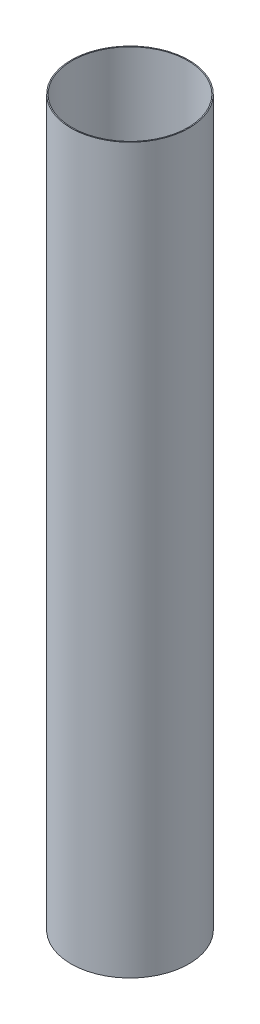
ISO-10303-21;
HEADER;
FILE_DESCRIPTION(('STEP AP214'),'2;1');
FILE_NAME('part.step','',(''),(''),'','','');
FILE_SCHEMA(('AUTOMOTIVE_DESIGN { 1 0 10303 214 1 1 1 1 }'));
ENDSEC;
DATA;
#1=APPLICATION_CONTEXT('core data for automotive mechanical design processes');
#2=APPLICATION_PROTOCOL_DEFINITION('international standard','automotive_design',2000,#1);
#3=PRODUCT_CONTEXT('',#1,'mechanical');
#4=PRODUCT('Part','Part','',(#3));
#5=PRODUCT_RELATED_PRODUCT_CATEGORY('part','',(#4));
#6=PRODUCT_DEFINITION_FORMATION('','',#4);
#7=PRODUCT_DEFINITION_CONTEXT('part definition',#1,'design');
#8=PRODUCT_DEFINITION('design','',#6,#7);
#9=PRODUCT_DEFINITION_SHAPE('','',#8);
#10=(LENGTH_UNIT() NAMED_UNIT(*) SI_UNIT(.MILLI.,.METRE.));
#11=(NAMED_UNIT(*) PLANE_ANGLE_UNIT() SI_UNIT($,.RADIAN.));
#12=(NAMED_UNIT(*) SI_UNIT($,.STERADIAN.) SOLID_ANGLE_UNIT());
#13=UNCERTAINTY_MEASURE_WITH_UNIT(LENGTH_MEASURE(1.E-05),#10,'distance_accuracy_value','');
#14=(GEOMETRIC_REPRESENTATION_CONTEXT(3) GLOBAL_UNCERTAINTY_ASSIGNED_CONTEXT((#13)) GLOBAL_UNIT_ASSIGNED_CONTEXT((#10,
#11,#12)) REPRESENTATION_CONTEXT('',''));
#15=CARTESIAN_POINT('',(0.,0.,0.));
#16=DIRECTION('',(0.,0.,1.));
#17=DIRECTION('',(1.,0.,0.));
#18=AXIS2_PLACEMENT_3D('',#15,#16,#17);
#19=CARTESIAN_POINT('',(0.,467.868,0.));
#20=DIRECTION('',(0.,1.,0.));
#21=DIRECTION('',(0.,0.,1.));
#22=AXIS2_PLACEMENT_3D('',#19,#20,#21);
#23=PLANE('',#22);
#24=CARTESIAN_POINT('',(0.,467.868,0.));
#25=DIRECTION('',(0.,1.,0.));
#26=DIRECTION('',(0.,0.,1.));
#27=AXIS2_PLACEMENT_3D('',#24,#25,#26);
#28=CIRCLE('',#27,38.1);
#29=CARTESIAN_POINT('',(0.,467.868,38.1));
#30=VERTEX_POINT('',#29);
#31=EDGE_CURVE('E10',#30,#30,#28,.T.);
#32=ORIENTED_EDGE('',*,*,#31,.T.);
#33=EDGE_LOOP('',(#32));
#34=FACE_BOUND('',#33,.T.);
#35=CARTESIAN_POINT('',(0.,467.868,0.));
#36=DIRECTION('',(0.,1.,0.));
#37=DIRECTION('',(0.,0.,1.));
#38=AXIS2_PLACEMENT_3D('',#35,#36,#37);
#39=CIRCLE('',#38,37.465);
#40=CARTESIAN_POINT('',(0.,467.868,37.465));
#41=VERTEX_POINT('',#40);
#42=EDGE_CURVE('E42',#41,#41,#39,.T.);
#43=ORIENTED_EDGE('',*,*,#42,.F.);
#44=EDGE_LOOP('',(#43));
#45=FACE_BOUND('',#44,.T.);
#46=ADVANCED_FACE('F31',(#34,#45),#23,.T.);
#47=CARTESIAN_POINT('',(0.,0.,0.));
#48=DIRECTION('',(0.,1.,0.));
#49=DIRECTION('',(0.,0.,1.));
#50=AXIS2_PLACEMENT_3D('',#47,#48,#49);
#51=PLANE('',#50);
#52=CARTESIAN_POINT('',(0.,0.,0.));
#53=DIRECTION('',(0.,1.,0.));
#54=DIRECTION('',(0.,0.,1.));
#55=AXIS2_PLACEMENT_3D('',#52,#53,#54);
#56=CIRCLE('',#55,38.1);
#57=CARTESIAN_POINT('',(0.,0.,38.1));
#58=VERTEX_POINT('',#57);
#59=EDGE_CURVE('E35',#58,#58,#56,.T.);
#60=ORIENTED_EDGE('',*,*,#59,.F.);
#61=EDGE_LOOP('',(#60));
#62=FACE_BOUND('',#61,.T.);
#63=CARTESIAN_POINT('',(0.,0.,0.));
#64=DIRECTION('',(0.,1.,0.));
#65=DIRECTION('',(0.,0.,1.));
#66=AXIS2_PLACEMENT_3D('',#63,#64,#65);
#67=CIRCLE('',#66,37.465);
#68=CARTESIAN_POINT('',(0.,0.,37.465));
#69=VERTEX_POINT('',#68);
#70=EDGE_CURVE('E44',#69,#69,#67,.T.);
#71=ORIENTED_EDGE('',*,*,#70,.T.);
#72=EDGE_LOOP('',(#71));
#73=FACE_BOUND('',#72,.T.);
#74=ADVANCED_FACE('F54',(#62,#73),#51,.F.);
#75=CARTESIAN_POINT('',(0.,467.868,0.));
#76=DIRECTION('',(0.,-1.,0.));
#77=DIRECTION('',(0.,0.,-1.));
#78=AXIS2_PLACEMENT_3D('',#75,#76,#77);
#79=CYLINDRICAL_SURFACE('',#78,38.1);
#80=ORIENTED_EDGE('',*,*,#31,.F.);
#81=EDGE_LOOP('',(#80));
#82=FACE_BOUND('',#81,.T.);
#83=ORIENTED_EDGE('',*,*,#59,.T.);
#84=EDGE_LOOP('',(#83));
#85=FACE_BOUND('',#84,.T.);
#86=ADVANCED_FACE('F33',(#82,#85),#79,.T.);
#87=CARTESIAN_POINT('',(0.,467.868,0.));
#88=DIRECTION('',(0.,-1.,0.));
#89=DIRECTION('',(0.,0.,-1.));
#90=AXIS2_PLACEMENT_3D('',#87,#88,#89);
#91=CYLINDRICAL_SURFACE('',#90,37.465);
#92=ORIENTED_EDGE('',*,*,#42,.T.);
#93=EDGE_LOOP('',(#92));
#94=FACE_BOUND('',#93,.T.);
#95=ORIENTED_EDGE('',*,*,#70,.F.);
#96=EDGE_LOOP('',(#95));
#97=FACE_BOUND('',#96,.T.);
#98=ADVANCED_FACE('F50',(#94,#97),#91,.F.);
#99=CLOSED_SHELL('',(#46,#74,#86,#98));
#100=MANIFOLD_SOLID_BREP('B2',#99);
#101=ADVANCED_BREP_SHAPE_REPRESENTATION('',(#18,#100),#14);
#102=SHAPE_DEFINITION_REPRESENTATION(#9,#101);
ENDSEC;
END-ISO-10303-21;
